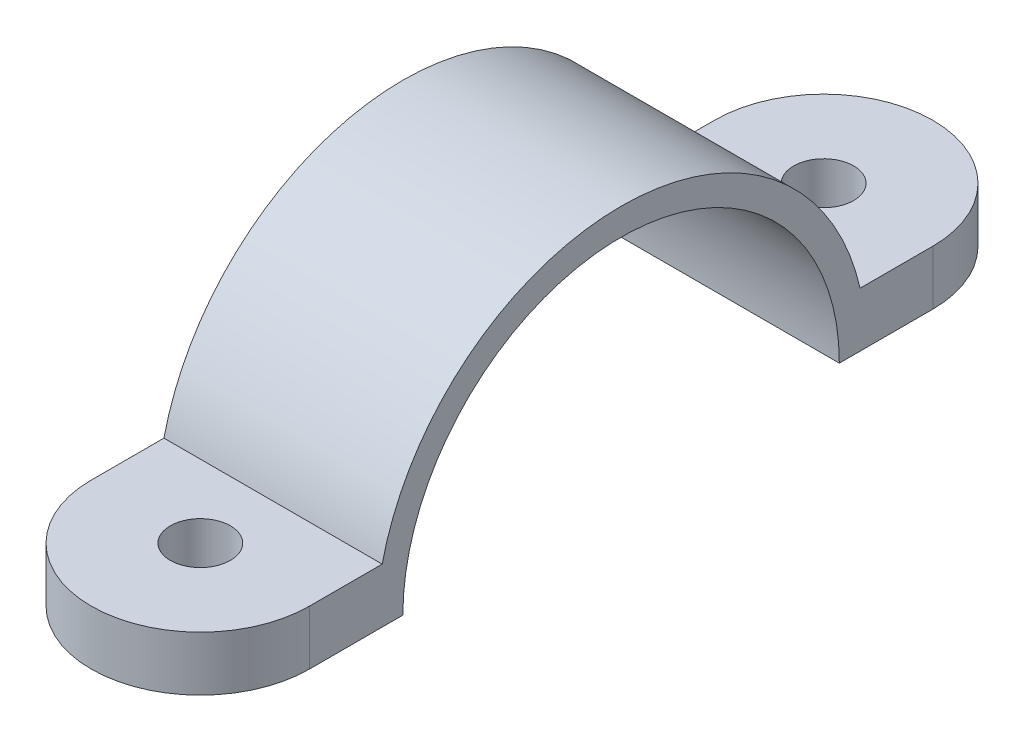
ISO-10303-21;
HEADER;
FILE_DESCRIPTION(('STEP AP214'),'2;1');
FILE_NAME('part.step','',(''),(''),'','','');
FILE_SCHEMA(('AUTOMOTIVE_DESIGN { 1 0 10303 214 1 1 1 1 }'));
ENDSEC;
DATA;
#1=APPLICATION_CONTEXT('core data for automotive mechanical design processes');
#2=APPLICATION_PROTOCOL_DEFINITION('international standard','automotive_design',2000,#1);
#3=PRODUCT_CONTEXT('',#1,'mechanical');
#4=PRODUCT('Part','Part','',(#3));
#5=PRODUCT_RELATED_PRODUCT_CATEGORY('part','',(#4));
#6=PRODUCT_DEFINITION_FORMATION('','',#4);
#7=PRODUCT_DEFINITION_CONTEXT('part definition',#1,'design');
#8=PRODUCT_DEFINITION('design','',#6,#7);
#9=PRODUCT_DEFINITION_SHAPE('','',#8);
#10=(LENGTH_UNIT() NAMED_UNIT(*) SI_UNIT(.MILLI.,.METRE.));
#11=(NAMED_UNIT(*) PLANE_ANGLE_UNIT() SI_UNIT($,.RADIAN.));
#12=(NAMED_UNIT(*) SI_UNIT($,.STERADIAN.) SOLID_ANGLE_UNIT());
#13=UNCERTAINTY_MEASURE_WITH_UNIT(LENGTH_MEASURE(1.E-05),#10,'distance_accuracy_value','');
#14=(GEOMETRIC_REPRESENTATION_CONTEXT(3) GLOBAL_UNCERTAINTY_ASSIGNED_CONTEXT((#13)) GLOBAL_UNIT_ASSIGNED_CONTEXT((#10,
#11,#12)) REPRESENTATION_CONTEXT('',''));
#15=CARTESIAN_POINT('',(0.,0.,0.));
#16=DIRECTION('',(0.,0.,1.));
#17=DIRECTION('',(1.,0.,0.));
#18=AXIS2_PLACEMENT_3D('',#15,#16,#17);
#19=CARTESIAN_POINT('',(12.,6.34908792207511E-13,-33.5126229483849));
#20=DIRECTION('',(0.,1.,0.));
#21=DIRECTION('',(0.,0.,1.));
#22=AXIS2_PLACEMENT_3D('',#19,#20,#21);
#23=PLANE('',#22);
#24=CARTESIAN_POINT('',(6.,0.,-38.6526229483844));
#25=DIRECTION('',(0.,1.,0.));
#26=DIRECTION('',(0.,0.,1.));
#27=AXIS2_PLACEMENT_3D('',#24,#25,#26);
#28=CIRCLE('',#27,1.65000000001569);
#29=CARTESIAN_POINT('',(6.,0.,-37.0026229483687));
#30=VERTEX_POINT('',#29);
#31=EDGE_CURVE('E288',#30,#30,#28,.T.);
#32=ORIENTED_EDGE('',*,*,#31,.T.);
#33=EDGE_LOOP('',(#32));
#34=FACE_BOUND('',#33,.T.);
#35=DIRECTION('',(0.,0.,-1.));
#36=VECTOR('',#35,1.);
#37=CARTESIAN_POINT('',(0.,6.34908792207511E-13,-33.5126229483849));
#38=LINE('',#37,#36);
#39=CARTESIAN_POINT('',(0.,6.36378368366488E-13,-33.5126229483849));
#40=VERTEX_POINT('',#39);
#41=CARTESIAN_POINT('',(0.,0.,-38.6526229483844));
#42=VERTEX_POINT('',#41);
#43=EDGE_CURVE('E167',#40,#42,#38,.T.);
#44=ORIENTED_EDGE('',*,*,#43,.T.);
#45=CARTESIAN_POINT('',(6.,0.,-38.6526229483844));
#46=DIRECTION('',(0.,1.,0.));
#47=DIRECTION('',(0.,0.,1.));
#48=AXIS2_PLACEMENT_3D('',#45,#46,#47);
#49=CIRCLE('',#48,6.);
#50=CARTESIAN_POINT('',(12.,0.,-38.6526229483844));
#51=VERTEX_POINT('',#50);
#52=EDGE_CURVE('E154',#42,#51,#49,.F.);
#53=ORIENTED_EDGE('',*,*,#52,.T.);
#54=DIRECTION('',(0.,0.,-1.));
#55=VECTOR('',#54,1.);
#56=CARTESIAN_POINT('',(12.,6.34908792207511E-13,-33.5126229483849));
#57=LINE('',#56,#55);
#58=CARTESIAN_POINT('',(12.,6.36378368366488E-13,-33.5126229483849));
#59=VERTEX_POINT('',#58);
#60=EDGE_CURVE('E232',#59,#51,#57,.T.);
#61=ORIENTED_EDGE('',*,*,#60,.F.);
#62=DIRECTION('',(-1.,0.,0.));
#63=VECTOR('',#62,1.);
#64=CARTESIAN_POINT('',(12.,6.36378368366488E-13,-33.5126229483849));
#65=LINE('',#64,#63);
#66=EDGE_CURVE('E172',#59,#40,#65,.T.);
#67=ORIENTED_EDGE('',*,*,#66,.T.);
#68=EDGE_LOOP('',(#44,#53,#61,#67));
#69=FACE_BOUND('',#68,.T.);
#70=ADVANCED_FACE('F91',(#34,#69),#23,.F.);
#71=CARTESIAN_POINT('',(12.,3.,-34.6526229483844));
#72=DIRECTION('',(0.,-1.,0.));
#73=DIRECTION('',(0.,0.,-1.));
#74=AXIS2_PLACEMENT_3D('',#71,#72,#73);
#75=PLANE('',#74);
#76=CARTESIAN_POINT('',(6.,3.,-38.6526229483844));
#77=DIRECTION('',(0.,-1.,0.));
#78=DIRECTION('',(0.,0.,-1.));
#79=AXIS2_PLACEMENT_3D('',#76,#77,#78);
#80=CIRCLE('',#79,1.65000000001569);
#81=CARTESIAN_POINT('',(6.,3.,-40.3026229484001));
#82=VERTEX_POINT('',#81);
#83=EDGE_CURVE('E203',#82,#82,#80,.F.);
#84=ORIENTED_EDGE('',*,*,#83,.F.);
#85=EDGE_LOOP('',(#84));
#86=FACE_BOUND('',#85,.T.);
#87=CARTESIAN_POINT('',(6.,3.,-38.6526229483844));
#88=DIRECTION('',(0.,-1.,0.));
#89=DIRECTION('',(0.,0.,-1.));
#90=AXIS2_PLACEMENT_3D('',#87,#88,#89);
#91=CIRCLE('',#90,6.);
#92=CARTESIAN_POINT('',(0.,3.,-38.6526229483844));
#93=VERTEX_POINT('',#92);
#94=CARTESIAN_POINT('',(12.,3.,-38.6526229483844));
#95=VERTEX_POINT('',#94);
#96=EDGE_CURVE('E106',#93,#95,#91,.T.);
#97=ORIENTED_EDGE('',*,*,#96,.F.);
#98=DIRECTION('',(0.,0.,1.));
#99=VECTOR('',#98,1.);
#100=CARTESIAN_POINT('',(0.,3.,-34.6526229483844));
#101=LINE('',#100,#99);
#102=CARTESIAN_POINT('',(0.,3.,-34.6526229483844));
#103=VERTEX_POINT('',#102);
#104=EDGE_CURVE('E169',#93,#103,#101,.T.);
#105=ORIENTED_EDGE('',*,*,#104,.T.);
#106=DIRECTION('',(-1.,0.,0.));
#107=VECTOR('',#106,1.);
#108=CARTESIAN_POINT('',(12.,3.,-34.6526229483844));
#109=LINE('',#108,#107);
#110=CARTESIAN_POINT('',(12.,3.,-34.6526229483844));
#111=VERTEX_POINT('',#110);
#112=EDGE_CURVE('E189',#111,#103,#109,.T.);
#113=ORIENTED_EDGE('',*,*,#112,.F.);
#114=DIRECTION('',(0.,0.,1.));
#115=VECTOR('',#114,1.);
#116=CARTESIAN_POINT('',(12.,3.,-34.6526229483844));
#117=LINE('',#116,#115);
#118=EDGE_CURVE('E223',#95,#111,#117,.T.);
#119=ORIENTED_EDGE('',*,*,#118,.F.);
#120=EDGE_LOOP('',(#97,#105,#113,#119));
#121=FACE_BOUND('',#120,.T.);
#122=ADVANCED_FACE('F222',(#86,#121),#75,.F.);
#123=CARTESIAN_POINT('',(0.,0.,-21.5145273572525));
#124=DIRECTION('',(-1.,0.,0.));
#125=DIRECTION('',(0.,0.,1.));
#126=AXIS2_PLACEMENT_3D('',#123,#124,#125);
#127=PLANE('',#126);
#128=ORIENTED_EDGE('',*,*,#104,.F.);
#129=DIRECTION('',(0.,-1.,0.));
#130=VECTOR('',#129,1.);
#131=CARTESIAN_POINT('',(0.,13.4762589675963,-38.6526229483844));
#132=LINE('',#131,#130);
#133=EDGE_CURVE('E12',#93,#42,#132,.T.);
#134=ORIENTED_EDGE('',*,*,#133,.T.);
#135=ORIENTED_EDGE('',*,*,#43,.F.);
#136=CARTESIAN_POINT('',(0.,6.34908792207511E-13,-21.5126229483849));
#137=DIRECTION('',(-1.,0.,0.));
#138=DIRECTION('',(0.,0.,1.));
#139=AXIS2_PLACEMENT_3D('',#136,#137,#138);
#140=CIRCLE('',#139,12.);
#141=CARTESIAN_POINT('',(0.,6.34908792207511E-13,-9.51262294838494));
#142=VERTEX_POINT('',#141);
#143=EDGE_CURVE('E173',#142,#40,#140,.T.);
#144=ORIENTED_EDGE('',*,*,#143,.F.);
#145=DIRECTION('',(0.,0.,-1.));
#146=VECTOR('',#145,1.);
#147=CARTESIAN_POINT('',(0.,0.,1.62356823387934));
#148=LINE('',#147,#146);
#149=CARTESIAN_POINT('',(0.,0.,-4.3764317661692));
#150=VERTEX_POINT('',#149);
#151=EDGE_CURVE('E177',#150,#142,#148,.T.);
#152=ORIENTED_EDGE('',*,*,#151,.F.);
#153=DIRECTION('',(0.,-1.,0.));
#154=VECTOR('',#153,1.);
#155=CARTESIAN_POINT('',(0.,13.4762589675963,-4.37643176612066));
#156=LINE('',#155,#154);
#157=CARTESIAN_POINT('',(0.,3.,-4.3764317661692));
#158=VERTEX_POINT('',#157);
#159=EDGE_CURVE('E99',#150,#158,#156,.F.);
#160=ORIENTED_EDGE('',*,*,#159,.T.);
#161=DIRECTION('',(0.,0.,1.));
#162=VECTOR('',#161,1.);
#163=CARTESIAN_POINT('',(0.,3.,1.62356823387934));
#164=LINE('',#163,#162);
#165=CARTESIAN_POINT('',(0.,3.,-8.37643176612066));
#166=VERTEX_POINT('',#165);
#167=EDGE_CURVE('E182',#166,#158,#164,.T.);
#168=ORIENTED_EDGE('',*,*,#167,.F.);
#169=CARTESIAN_POINT('',(0.,0.,-21.5145273572525));
#170=DIRECTION('',(1.,0.,0.));
#171=DIRECTION('',(0.,0.,1.));
#172=AXIS2_PLACEMENT_3D('',#169,#170,#171);
#173=CIRCLE('',#172,13.4762589675963);
#174=EDGE_CURVE('E175',#103,#166,#173,.T.);
#175=ORIENTED_EDGE('',*,*,#174,.F.);
#176=EDGE_LOOP('',(#128,#134,#135,#144,#152,#160,#168,#175));
#177=FACE_BOUND('',#176,.T.);
#178=ADVANCED_FACE('F165',(#177),#127,.T.);
#179=CARTESIAN_POINT('',(12.,0.,1.62356823387934));
#180=DIRECTION('',(0.,1.,0.));
#181=DIRECTION('',(0.,0.,1.));
#182=AXIS2_PLACEMENT_3D('',#179,#180,#181);
#183=PLANE('',#182);
#184=CARTESIAN_POINT('',(6.,0.,-4.37643176612066));
#185=DIRECTION('',(0.,1.,0.));
#186=DIRECTION('',(0.,0.,1.));
#187=AXIS2_PLACEMENT_3D('',#184,#185,#186);
#188=CIRCLE('',#187,1.65000000001568);
#189=CARTESIAN_POINT('',(6.,0.,-2.72643176610498));
#190=VERTEX_POINT('',#189);
#191=EDGE_CURVE('E287',#190,#190,#188,.T.);
#192=ORIENTED_EDGE('',*,*,#191,.T.);
#193=EDGE_LOOP('',(#192));
#194=FACE_BOUND('',#193,.T.);
#195=CARTESIAN_POINT('',(6.,0.,-4.37643176612066));
#196=DIRECTION('',(0.,1.,0.));
#197=DIRECTION('',(0.,0.,1.));
#198=AXIS2_PLACEMENT_3D('',#195,#196,#197);
#199=CIRCLE('',#198,6.);
#200=CARTESIAN_POINT('',(12.,3.42078605775567E-13,-4.3764317661743));
#201=VERTEX_POINT('',#200);
#202=EDGE_CURVE('E114',#150,#201,#199,.T.);
#203=ORIENTED_EDGE('',*,*,#202,.F.);
#204=ORIENTED_EDGE('',*,*,#151,.T.);
#205=DIRECTION('',(-1.,0.,0.));
#206=VECTOR('',#205,1.);
#207=CARTESIAN_POINT('',(12.,6.34908792207511E-13,-9.51262294838494));
#208=LINE('',#207,#206);
#209=CARTESIAN_POINT('',(12.,6.34908792207511E-13,-9.51262294838494));
#210=VERTEX_POINT('',#209);
#211=EDGE_CURVE('E194',#210,#142,#208,.T.);
#212=ORIENTED_EDGE('',*,*,#211,.F.);
#213=DIRECTION('',(0.,0.,-1.));
#214=VECTOR('',#213,1.);
#215=CARTESIAN_POINT('',(12.,0.,1.62356823387934));
#216=LINE('',#215,#214);
#217=EDGE_CURVE('E185',#201,#210,#216,.T.);
#218=ORIENTED_EDGE('',*,*,#217,.F.);
#219=EDGE_LOOP('',(#203,#204,#212,#218));
#220=FACE_BOUND('',#219,.T.);
#221=ADVANCED_FACE('F93',(#194,#220),#183,.F.);
#222=CARTESIAN_POINT('',(12.,3.,1.62356823387934));
#223=DIRECTION('',(0.,-1.,0.));
#224=DIRECTION('',(0.,0.,-1.));
#225=AXIS2_PLACEMENT_3D('',#222,#223,#224);
#226=PLANE('',#225);
#227=CARTESIAN_POINT('',(6.,3.,-4.37643176612066));
#228=DIRECTION('',(0.,-1.,0.));
#229=DIRECTION('',(0.,0.,-1.));
#230=AXIS2_PLACEMENT_3D('',#227,#228,#229);
#231=CIRCLE('',#230,1.65000000001568);
#232=CARTESIAN_POINT('',(6.,3.,-6.02643176613635));
#233=VERTEX_POINT('',#232);
#234=EDGE_CURVE('E200',#233,#233,#231,.F.);
#235=ORIENTED_EDGE('',*,*,#234,.F.);
#236=EDGE_LOOP('',(#235));
#237=FACE_BOUND('',#236,.T.);
#238=ORIENTED_EDGE('',*,*,#167,.T.);
#239=CARTESIAN_POINT('',(6.,3.,-4.37643176612066));
#240=DIRECTION('',(0.,-1.,0.));
#241=DIRECTION('',(0.,0.,-1.));
#242=AXIS2_PLACEMENT_3D('',#239,#240,#241);
#243=CIRCLE('',#242,6.);
#244=CARTESIAN_POINT('',(12.,3.,-4.37643176617431));
#245=VERTEX_POINT('',#244);
#246=EDGE_CURVE('E204',#158,#245,#243,.F.);
#247=ORIENTED_EDGE('',*,*,#246,.T.);
#248=DIRECTION('',(0.,0.,1.));
#249=VECTOR('',#248,1.);
#250=CARTESIAN_POINT('',(12.,3.,1.62356823387934));
#251=LINE('',#250,#249);
#252=CARTESIAN_POINT('',(12.,3.,-8.37643176612066));
#253=VERTEX_POINT('',#252);
#254=EDGE_CURVE('E190',#253,#245,#251,.T.);
#255=ORIENTED_EDGE('',*,*,#254,.F.);
#256=DIRECTION('',(-1.,0.,0.));
#257=VECTOR('',#256,1.);
#258=CARTESIAN_POINT('',(12.,3.,-8.37643176612066));
#259=LINE('',#258,#257);
#260=EDGE_CURVE('E186',#253,#166,#259,.T.);
#261=ORIENTED_EDGE('',*,*,#260,.T.);
#262=EDGE_LOOP('',(#238,#247,#255,#261));
#263=FACE_BOUND('',#262,.T.);
#264=ADVANCED_FACE('F211',(#237,#263),#226,.F.);
#265=CARTESIAN_POINT('',(12.,0.,-21.5145273572525));
#266=DIRECTION('',(-1.,0.,0.));
#267=DIRECTION('',(0.,0.,1.));
#268=AXIS2_PLACEMENT_3D('',#265,#266,#267);
#269=PLANE('',#268);
#270=DIRECTION('',(0.,-1.,0.));
#271=VECTOR('',#270,1.);
#272=CARTESIAN_POINT('',(12.,13.4762589675963,-4.37643176612066));
#273=LINE('',#272,#271);
#274=EDGE_CURVE('E198',#201,#245,#273,.F.);
#275=ORIENTED_EDGE('',*,*,#274,.F.);
#276=ORIENTED_EDGE('',*,*,#217,.T.);
#277=CARTESIAN_POINT('',(12.,6.34908792207511E-13,-21.5126229483849));
#278=DIRECTION('',(-1.,0.,0.));
#279=DIRECTION('',(0.,0.,1.));
#280=AXIS2_PLACEMENT_3D('',#277,#278,#279);
#281=CIRCLE('',#280,12.);
#282=EDGE_CURVE('E230',#210,#59,#281,.T.);
#283=ORIENTED_EDGE('',*,*,#282,.T.);
#284=ORIENTED_EDGE('',*,*,#60,.T.);
#285=DIRECTION('',(0.,-1.,0.));
#286=VECTOR('',#285,1.);
#287=CARTESIAN_POINT('',(12.,13.4762589675963,-38.6526229483844));
#288=LINE('',#287,#286);
#289=EDGE_CURVE('E157',#95,#51,#288,.T.);
#290=ORIENTED_EDGE('',*,*,#289,.F.);
#291=ORIENTED_EDGE('',*,*,#118,.T.);
#292=CARTESIAN_POINT('',(12.,0.,-21.5145273572525));
#293=DIRECTION('',(1.,0.,0.));
#294=DIRECTION('',(0.,0.,1.));
#295=AXIS2_PLACEMENT_3D('',#292,#293,#294);
#296=CIRCLE('',#295,13.4762589675963);
#297=EDGE_CURVE('E218',#111,#253,#296,.T.);
#298=ORIENTED_EDGE('',*,*,#297,.T.);
#299=ORIENTED_EDGE('',*,*,#254,.T.);
#300=EDGE_LOOP('',(#275,#276,#283,#284,#290,#291,#298,#299));
#301=FACE_BOUND('',#300,.T.);
#302=ADVANCED_FACE('F243',(#301),#269,.F.);
#303=CARTESIAN_POINT('',(12.,6.34908792207511E-13,-21.5126229483849));
#304=DIRECTION('',(-1.,0.,0.));
#305=DIRECTION('',(0.,0.,1.));
#306=AXIS2_PLACEMENT_3D('',#303,#304,#305);
#307=CYLINDRICAL_SURFACE('',#306,12.);
#308=ORIENTED_EDGE('',*,*,#143,.T.);
#309=ORIENTED_EDGE('',*,*,#66,.F.);
#310=ORIENTED_EDGE('',*,*,#282,.F.);
#311=ORIENTED_EDGE('',*,*,#211,.T.);
#312=EDGE_LOOP('',(#308,#309,#310,#311));
#313=FACE_BOUND('',#312,.T.);
#314=ADVANCED_FACE('F241',(#313),#307,.F.);
#315=CARTESIAN_POINT('',(12.,0.,-21.5145273572525));
#316=DIRECTION('',(-1.,0.,0.));
#317=DIRECTION('',(0.,0.,1.));
#318=AXIS2_PLACEMENT_3D('',#315,#316,#317);
#319=CYLINDRICAL_SURFACE('',#318,13.4762589675963);
#320=ORIENTED_EDGE('',*,*,#174,.T.);
#321=ORIENTED_EDGE('',*,*,#260,.F.);
#322=ORIENTED_EDGE('',*,*,#297,.F.);
#323=ORIENTED_EDGE('',*,*,#112,.T.);
#324=EDGE_LOOP('',(#320,#321,#322,#323));
#325=FACE_BOUND('',#324,.T.);
#326=ADVANCED_FACE('F217',(#325),#319,.T.);
#327=CARTESIAN_POINT('',(6.,13.4762589675963,-38.6526229483844));
#328=DIRECTION('',(0.,-1.,0.));
#329=DIRECTION('',(0.,0.,-1.));
#330=AXIS2_PLACEMENT_3D('',#327,#328,#329);
#331=CYLINDRICAL_SURFACE('',#330,6.);
#332=ORIENTED_EDGE('',*,*,#96,.T.);
#333=ORIENTED_EDGE('',*,*,#289,.T.);
#334=ORIENTED_EDGE('',*,*,#52,.F.);
#335=ORIENTED_EDGE('',*,*,#133,.F.);
#336=EDGE_LOOP('',(#332,#333,#334,#335));
#337=FACE_BOUND('',#336,.T.);
#338=ADVANCED_FACE('F155',(#337),#331,.T.);
#339=CARTESIAN_POINT('',(6.,13.4762589675963,-4.37643176612066));
#340=DIRECTION('',(0.,-1.,0.));
#341=DIRECTION('',(0.,0.,-1.));
#342=AXIS2_PLACEMENT_3D('',#339,#340,#341);
#343=CYLINDRICAL_SURFACE('',#342,6.);
#344=ORIENTED_EDGE('',*,*,#246,.F.);
#345=ORIENTED_EDGE('',*,*,#159,.F.);
#346=ORIENTED_EDGE('',*,*,#202,.T.);
#347=ORIENTED_EDGE('',*,*,#274,.T.);
#348=EDGE_LOOP('',(#344,#345,#346,#347));
#349=FACE_BOUND('',#348,.T.);
#350=ADVANCED_FACE('F244',(#349),#343,.T.);
#351=CARTESIAN_POINT('',(6.,13.4762589675963,-4.37643176612066));
#352=DIRECTION('',(0.,-1.,0.));
#353=DIRECTION('',(0.,0.,-1.));
#354=AXIS2_PLACEMENT_3D('',#351,#352,#353);
#355=CYLINDRICAL_SURFACE('',#354,1.65000000001568);
#356=ORIENTED_EDGE('',*,*,#191,.F.);
#357=EDGE_LOOP('',(#356));
#358=FACE_BOUND('',#357,.T.);
#359=ORIENTED_EDGE('',*,*,#234,.T.);
#360=EDGE_LOOP('',(#359));
#361=FACE_BOUND('',#360,.T.);
#362=ADVANCED_FACE('F246',(#358,#361),#355,.F.);
#363=CARTESIAN_POINT('',(6.,13.4762589675963,-38.6526229483844));
#364=DIRECTION('',(0.,-1.,0.));
#365=DIRECTION('',(0.,0.,-1.));
#366=AXIS2_PLACEMENT_3D('',#363,#364,#365);
#367=CYLINDRICAL_SURFACE('',#366,1.65000000001569);
#368=ORIENTED_EDGE('',*,*,#31,.F.);
#369=EDGE_LOOP('',(#368));
#370=FACE_BOUND('',#369,.T.);
#371=ORIENTED_EDGE('',*,*,#83,.T.);
#372=EDGE_LOOP('',(#371));
#373=FACE_BOUND('',#372,.T.);
#374=ADVANCED_FACE('F252',(#370,#373),#367,.F.);
#375=CLOSED_SHELL('',(#70,#122,#178,#221,#264,#302,#314,#326,#338,#350,#362,#374));
#376=MANIFOLD_SOLID_BREP('B2',#375);
#377=ADVANCED_BREP_SHAPE_REPRESENTATION('',(#18,#376),#14);
#378=SHAPE_DEFINITION_REPRESENTATION(#9,#377);
ENDSEC;
END-ISO-10303-21;
